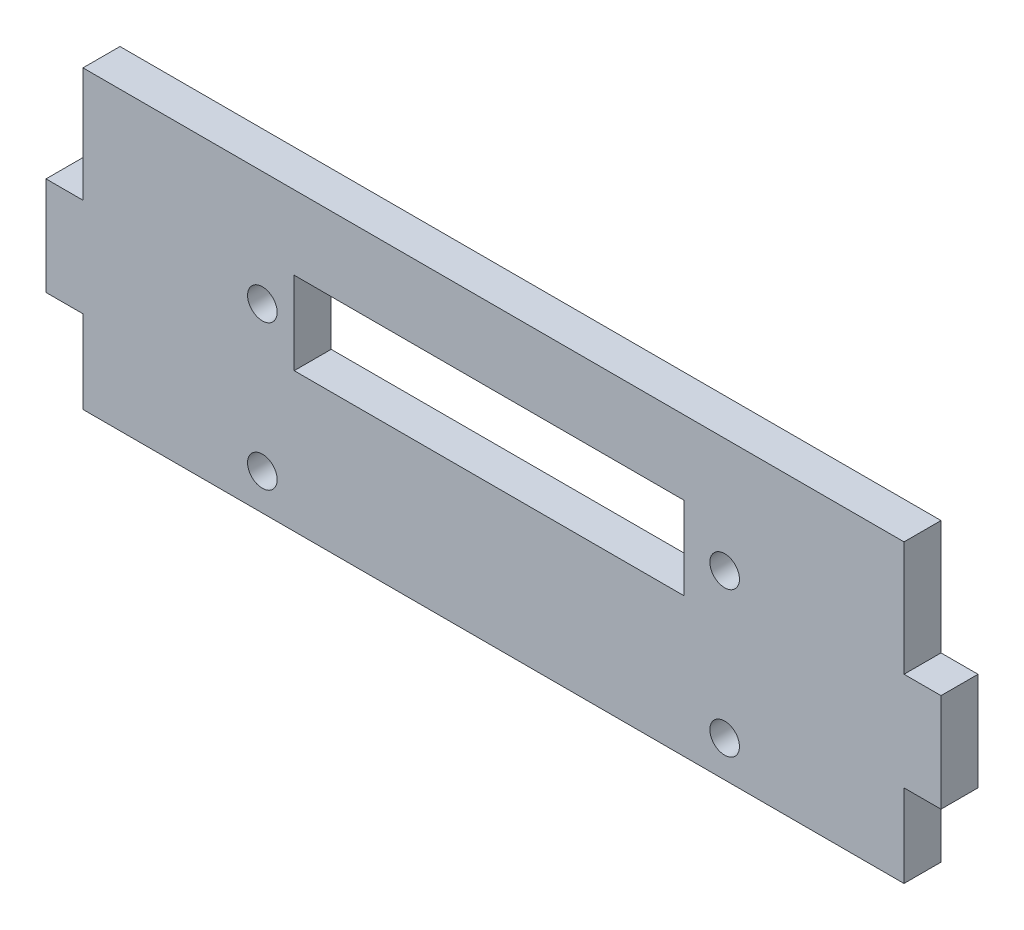
ISO-10303-21;
HEADER;
FILE_DESCRIPTION(('STEP AP214'),'2;1');
FILE_NAME('part.step','',(''),(''),'','','');
FILE_SCHEMA(('AUTOMOTIVE_DESIGN { 1 0 10303 214 1 1 1 1 }'));
ENDSEC;
DATA;
#1=APPLICATION_CONTEXT('core data for automotive mechanical design processes');
#2=APPLICATION_PROTOCOL_DEFINITION('international standard','automotive_design',2000,#1);
#3=PRODUCT_CONTEXT('',#1,'mechanical');
#4=PRODUCT('Part','Part','',(#3));
#5=PRODUCT_RELATED_PRODUCT_CATEGORY('part','',(#4));
#6=PRODUCT_DEFINITION_FORMATION('','',#4);
#7=PRODUCT_DEFINITION_CONTEXT('part definition',#1,'design');
#8=PRODUCT_DEFINITION('design','',#6,#7);
#9=PRODUCT_DEFINITION_SHAPE('','',#8);
#10=(LENGTH_UNIT() NAMED_UNIT(*) SI_UNIT(.MILLI.,.METRE.));
#11=(NAMED_UNIT(*) PLANE_ANGLE_UNIT() SI_UNIT($,.RADIAN.));
#12=(NAMED_UNIT(*) SI_UNIT($,.STERADIAN.) SOLID_ANGLE_UNIT());
#13=UNCERTAINTY_MEASURE_WITH_UNIT(LENGTH_MEASURE(1.E-05),#10,'distance_accuracy_value','');
#14=(GEOMETRIC_REPRESENTATION_CONTEXT(3) GLOBAL_UNCERTAINTY_ASSIGNED_CONTEXT((#13)) GLOBAL_UNIT_ASSIGNED_CONTEXT((#10,
#11,#12)) REPRESENTATION_CONTEXT('',''));
#15=CARTESIAN_POINT('',(0.,0.,0.));
#16=DIRECTION('',(0.,0.,1.));
#17=DIRECTION('',(1.,0.,0.));
#18=AXIS2_PLACEMENT_3D('',#15,#16,#17);
#19=CARTESIAN_POINT('',(111.,0.,5.));
#20=DIRECTION('',(-1.,0.,0.));
#21=DIRECTION('',(0.,0.,1.));
#22=AXIS2_PLACEMENT_3D('',#19,#20,#21);
#23=PLANE('',#22);
#24=DIRECTION('',(0.,0.,1.));
#25=VECTOR('',#24,1.);
#26=CARTESIAN_POINT('',(111.,24.5,5.));
#27=LINE('',#26,#25);
#28=CARTESIAN_POINT('',(111.,24.5,0.));
#29=VERTEX_POINT('',#28);
#30=CARTESIAN_POINT('',(111.,24.5,5.));
#31=VERTEX_POINT('',#30);
#32=EDGE_CURVE('E174',#29,#31,#27,.T.);
#33=ORIENTED_EDGE('',*,*,#32,.F.);
#34=DIRECTION('',(0.,1.,0.));
#35=VECTOR('',#34,1.);
#36=CARTESIAN_POINT('',(111.,0.,0.));
#37=LINE('',#36,#35);
#38=CARTESIAN_POINT('',(111.,40.,0.));
#39=VERTEX_POINT('',#38);
#40=EDGE_CURVE('E258',#29,#39,#37,.T.);
#41=ORIENTED_EDGE('',*,*,#40,.T.);
#42=DIRECTION('',(0.,0.,-1.));
#43=VECTOR('',#42,1.);
#44=CARTESIAN_POINT('',(111.,40.,5.));
#45=LINE('',#44,#43);
#46=CARTESIAN_POINT('',(111.,40.,5.));
#47=VERTEX_POINT('',#46);
#48=EDGE_CURVE('E265',#47,#39,#45,.T.);
#49=ORIENTED_EDGE('',*,*,#48,.F.);
#50=DIRECTION('',(0.,1.,0.));
#51=VECTOR('',#50,1.);
#52=CARTESIAN_POINT('',(111.,0.,5.));
#53=LINE('',#52,#51);
#54=EDGE_CURVE('E57',#31,#47,#53,.T.);
#55=ORIENTED_EDGE('',*,*,#54,.F.);
#56=EDGE_LOOP('',(#33,#41,#49,#55));
#57=FACE_BOUND('',#56,.T.);
#58=ADVANCED_FACE('F40',(#57),#23,.F.);
#59=DIRECTION('',(0.,0.,-1.));
#60=VECTOR('',#59,1.);
#61=CARTESIAN_POINT('',(111.,11.2,5.));
#62=LINE('',#61,#60);
#63=CARTESIAN_POINT('',(111.,11.2,5.));
#64=VERTEX_POINT('',#63);
#65=CARTESIAN_POINT('',(111.,11.2,0.));
#66=VERTEX_POINT('',#65);
#67=EDGE_CURVE('E65',#64,#66,#62,.T.);
#68=ORIENTED_EDGE('',*,*,#67,.F.);
#69=CARTESIAN_POINT('',(111.,0.,5.));
#70=VERTEX_POINT('',#69);
#71=EDGE_CURVE('E178',#70,#64,#53,.T.);
#72=ORIENTED_EDGE('',*,*,#71,.F.);
#73=DIRECTION('',(0.,0.,-1.));
#74=VECTOR('',#73,1.);
#75=CARTESIAN_POINT('',(111.,0.,5.));
#76=LINE('',#75,#74);
#77=CARTESIAN_POINT('',(111.,0.,0.));
#78=VERTEX_POINT('',#77);
#79=EDGE_CURVE('E268',#70,#78,#76,.T.);
#80=ORIENTED_EDGE('',*,*,#79,.T.);
#81=EDGE_CURVE('E259',#78,#66,#37,.T.);
#82=ORIENTED_EDGE('',*,*,#81,.T.);
#83=EDGE_LOOP('',(#68,#72,#80,#82));
#84=FACE_BOUND('',#83,.T.);
#85=ADVANCED_FACE('F336',(#84),#23,.F.);
#86=CARTESIAN_POINT('',(0.,0.,5.));
#87=DIRECTION('',(1.,0.,0.));
#88=DIRECTION('',(0.,0.,-1.));
#89=AXIS2_PLACEMENT_3D('',#86,#87,#88);
#90=PLANE('',#89);
#91=DIRECTION('',(0.,0.,-1.));
#92=VECTOR('',#91,1.);
#93=CARTESIAN_POINT('',(0.,24.5,0.));
#94=LINE('',#93,#92);
#95=CARTESIAN_POINT('',(0.,24.5,5.));
#96=VERTEX_POINT('',#95);
#97=CARTESIAN_POINT('',(0.,24.5,0.));
#98=VERTEX_POINT('',#97);
#99=EDGE_CURVE('E182',#96,#98,#94,.T.);
#100=ORIENTED_EDGE('',*,*,#99,.F.);
#101=DIRECTION('',(0.,-1.,0.));
#102=VECTOR('',#101,1.);
#103=CARTESIAN_POINT('',(0.,0.,5.));
#104=LINE('',#103,#102);
#105=CARTESIAN_POINT('',(0.,40.,5.));
#106=VERTEX_POINT('',#105);
#107=EDGE_CURVE('E244',#106,#96,#104,.T.);
#108=ORIENTED_EDGE('',*,*,#107,.F.);
#109=DIRECTION('',(0.,0.,-1.));
#110=VECTOR('',#109,1.);
#111=CARTESIAN_POINT('',(0.,40.,5.));
#112=LINE('',#111,#110);
#113=CARTESIAN_POINT('',(0.,40.,0.));
#114=VERTEX_POINT('',#113);
#115=EDGE_CURVE('E252',#106,#114,#112,.T.);
#116=ORIENTED_EDGE('',*,*,#115,.T.);
#117=DIRECTION('',(0.,-1.,0.));
#118=VECTOR('',#117,1.);
#119=CARTESIAN_POINT('',(0.,0.,0.));
#120=LINE('',#119,#118);
#121=EDGE_CURVE('E253',#114,#98,#120,.T.);
#122=ORIENTED_EDGE('',*,*,#121,.T.);
#123=EDGE_LOOP('',(#100,#108,#116,#122));
#124=FACE_BOUND('',#123,.T.);
#125=ADVANCED_FACE('F42',(#124),#90,.F.);
#126=DIRECTION('',(0.,0.,1.));
#127=VECTOR('',#126,1.);
#128=CARTESIAN_POINT('',(0.,11.2,0.));
#129=LINE('',#128,#127);
#130=CARTESIAN_POINT('',(0.,11.2,0.));
#131=VERTEX_POINT('',#130);
#132=CARTESIAN_POINT('',(0.,11.2,5.));
#133=VERTEX_POINT('',#132);
#134=EDGE_CURVE('E179',#131,#133,#129,.T.);
#135=ORIENTED_EDGE('',*,*,#134,.F.);
#136=CARTESIAN_POINT('',(0.,0.,0.));
#137=VERTEX_POINT('',#136);
#138=EDGE_CURVE('E256',#131,#137,#120,.T.);
#139=ORIENTED_EDGE('',*,*,#138,.T.);
#140=DIRECTION('',(0.,0.,-1.));
#141=VECTOR('',#140,1.);
#142=CARTESIAN_POINT('',(0.,0.,5.));
#143=LINE('',#142,#141);
#144=CARTESIAN_POINT('',(0.,0.,5.));
#145=VERTEX_POINT('',#144);
#146=EDGE_CURVE('E271',#145,#137,#143,.T.);
#147=ORIENTED_EDGE('',*,*,#146,.F.);
#148=EDGE_CURVE('E247',#133,#145,#104,.T.);
#149=ORIENTED_EDGE('',*,*,#148,.F.);
#150=EDGE_LOOP('',(#135,#139,#147,#149));
#151=FACE_BOUND('',#150,.T.);
#152=ADVANCED_FACE('F295',(#151),#90,.F.);
#153=CARTESIAN_POINT('',(0.,0.,5.));
#154=DIRECTION('',(0.,1.,0.));
#155=DIRECTION('',(0.,0.,1.));
#156=AXIS2_PLACEMENT_3D('',#153,#154,#155);
#157=PLANE('',#156);
#158=DIRECTION('',(1.,0.,0.));
#159=VECTOR('',#158,1.);
#160=CARTESIAN_POINT('',(0.,0.,0.));
#161=LINE('',#160,#159);
#162=EDGE_CURVE('E255',#137,#78,#161,.T.);
#163=ORIENTED_EDGE('',*,*,#162,.T.);
#164=ORIENTED_EDGE('',*,*,#79,.F.);
#165=DIRECTION('',(1.,0.,0.));
#166=VECTOR('',#165,1.);
#167=CARTESIAN_POINT('',(0.,0.,5.));
#168=LINE('',#167,#166);
#169=EDGE_CURVE('E246',#145,#70,#168,.T.);
#170=ORIENTED_EDGE('',*,*,#169,.F.);
#171=ORIENTED_EDGE('',*,*,#146,.T.);
#172=EDGE_LOOP('',(#163,#164,#170,#171));
#173=FACE_BOUND('',#172,.T.);
#174=ADVANCED_FACE('F304',(#173),#157,.F.);
#175=CARTESIAN_POINT('',(0.,40.,5.));
#176=DIRECTION('',(0.,-1.,0.));
#177=DIRECTION('',(0.,0.,-1.));
#178=AXIS2_PLACEMENT_3D('',#175,#176,#177);
#179=PLANE('',#178);
#180=DIRECTION('',(-1.,0.,0.));
#181=VECTOR('',#180,1.);
#182=CARTESIAN_POINT('',(0.,40.,0.));
#183=LINE('',#182,#181);
#184=EDGE_CURVE('E261',#39,#114,#183,.T.);
#185=ORIENTED_EDGE('',*,*,#184,.T.);
#186=ORIENTED_EDGE('',*,*,#115,.F.);
#187=DIRECTION('',(-1.,0.,0.));
#188=VECTOR('',#187,1.);
#189=CARTESIAN_POINT('',(0.,40.,5.));
#190=LINE('',#189,#188);
#191=EDGE_CURVE('E250',#47,#106,#190,.T.);
#192=ORIENTED_EDGE('',*,*,#191,.F.);
#193=ORIENTED_EDGE('',*,*,#48,.T.);
#194=EDGE_LOOP('',(#185,#186,#192,#193));
#195=FACE_BOUND('',#194,.T.);
#196=ADVANCED_FACE('F322',(#195),#179,.F.);
#197=CARTESIAN_POINT('',(0.,0.,5.));
#198=DIRECTION('',(0.,0.,-1.));
#199=DIRECTION('',(-1.,0.,0.));
#200=AXIS2_PLACEMENT_3D('',#197,#198,#199);
#201=PLANE('',#200);
#202=CARTESIAN_POINT('',(86.75,24.5,5.));
#203=DIRECTION('',(0.,0.,1.));
#204=DIRECTION('',(1.,0.,0.));
#205=AXIS2_PLACEMENT_3D('',#202,#203,#204);
#206=CIRCLE('',#205,2.);
#207=CARTESIAN_POINT('',(88.75,24.5,5.));
#208=VERTEX_POINT('',#207);
#209=EDGE_CURVE('E235',#208,#208,#206,.T.);
#210=ORIENTED_EDGE('',*,*,#209,.F.);
#211=EDGE_LOOP('',(#210));
#212=FACE_BOUND('',#211,.T.);
#213=CARTESIAN_POINT('',(24.25,4.9,5.));
#214=DIRECTION('',(0.,0.,1.));
#215=DIRECTION('',(1.,0.,0.));
#216=AXIS2_PLACEMENT_3D('',#213,#214,#215);
#217=CIRCLE('',#216,2.);
#218=CARTESIAN_POINT('',(26.25,4.9,5.));
#219=VERTEX_POINT('',#218);
#220=EDGE_CURVE('E215',#219,#219,#217,.T.);
#221=ORIENTED_EDGE('',*,*,#220,.F.);
#222=EDGE_LOOP('',(#221));
#223=FACE_BOUND('',#222,.T.);
#224=CARTESIAN_POINT('',(86.75,4.9,5.));
#225=DIRECTION('',(0.,0.,1.));
#226=DIRECTION('',(1.,0.,0.));
#227=AXIS2_PLACEMENT_3D('',#224,#225,#226);
#228=CIRCLE('',#227,2.);
#229=CARTESIAN_POINT('',(88.75,4.9,5.));
#230=VERTEX_POINT('',#229);
#231=EDGE_CURVE('E212',#230,#230,#228,.T.);
#232=ORIENTED_EDGE('',*,*,#231,.F.);
#233=EDGE_LOOP('',(#232));
#234=FACE_BOUND('',#233,.T.);
#235=DIRECTION('',(1.,0.,0.));
#236=VECTOR('',#235,1.);
#237=CARTESIAN_POINT('',(28.5554986658765,18.8204020153264,5.));
#238=LINE('',#237,#236);
#239=CARTESIAN_POINT('',(28.5554986658765,18.8204020153264,5.));
#240=VERTEX_POINT('',#239);
#241=CARTESIAN_POINT('',(81.2554986658765,18.8204020153264,5.));
#242=VERTEX_POINT('',#241);
#243=EDGE_CURVE('E218',#240,#242,#238,.T.);
#244=ORIENTED_EDGE('',*,*,#243,.F.);
#245=DIRECTION('',(0.,-1.,0.));
#246=VECTOR('',#245,1.);
#247=CARTESIAN_POINT('',(28.5554986658765,30.,5.));
#248=LINE('',#247,#246);
#249=CARTESIAN_POINT('',(28.5554986658765,30.,5.));
#250=VERTEX_POINT('',#249);
#251=EDGE_CURVE('E211',#250,#240,#248,.T.);
#252=ORIENTED_EDGE('',*,*,#251,.F.);
#253=DIRECTION('',(-1.,0.,0.));
#254=VECTOR('',#253,1.);
#255=CARTESIAN_POINT('',(28.5554986658765,30.,5.));
#256=LINE('',#255,#254);
#257=CARTESIAN_POINT('',(81.2554986658765,30.,5.));
#258=VERTEX_POINT('',#257);
#259=EDGE_CURVE('E224',#258,#250,#256,.T.);
#260=ORIENTED_EDGE('',*,*,#259,.F.);
#261=DIRECTION('',(0.,1.,0.));
#262=VECTOR('',#261,1.);
#263=CARTESIAN_POINT('',(81.2554986658765,30.,5.));
#264=LINE('',#263,#262);
#265=EDGE_CURVE('E221',#242,#258,#264,.T.);
#266=ORIENTED_EDGE('',*,*,#265,.F.);
#267=EDGE_LOOP('',(#244,#252,#260,#266));
#268=FACE_BOUND('',#267,.T.);
#269=CARTESIAN_POINT('',(24.25,24.5,5.));
#270=DIRECTION('',(0.,0.,1.));
#271=DIRECTION('',(1.,0.,0.));
#272=AXIS2_PLACEMENT_3D('',#269,#270,#271);
#273=CIRCLE('',#272,2.00000000000001);
#274=CARTESIAN_POINT('',(26.25,24.5,5.));
#275=VERTEX_POINT('',#274);
#276=EDGE_CURVE('E238',#275,#275,#273,.T.);
#277=ORIENTED_EDGE('',*,*,#276,.F.);
#278=EDGE_LOOP('',(#277));
#279=FACE_BOUND('',#278,.T.);
#280=ORIENTED_EDGE('',*,*,#107,.T.);
#281=DIRECTION('',(1.,0.,0.));
#282=VECTOR('',#281,1.);
#283=CARTESIAN_POINT('',(-5.,24.5,5.));
#284=LINE('',#283,#282);
#285=CARTESIAN_POINT('',(-5.,24.5,5.));
#286=VERTEX_POINT('',#285);
#287=EDGE_CURVE('E202',#286,#96,#284,.T.);
#288=ORIENTED_EDGE('',*,*,#287,.F.);
#289=DIRECTION('',(0.,1.,0.));
#290=VECTOR('',#289,1.);
#291=CARTESIAN_POINT('',(-5.,24.5,5.));
#292=LINE('',#291,#290);
#293=CARTESIAN_POINT('',(-5.,11.2,5.));
#294=VERTEX_POINT('',#293);
#295=EDGE_CURVE('E193',#294,#286,#292,.T.);
#296=ORIENTED_EDGE('',*,*,#295,.F.);
#297=DIRECTION('',(1.,0.,0.));
#298=VECTOR('',#297,1.);
#299=CARTESIAN_POINT('',(-5.,11.2,5.));
#300=LINE('',#299,#298);
#301=EDGE_CURVE('E205',#294,#133,#300,.T.);
#302=ORIENTED_EDGE('',*,*,#301,.T.);
#303=ORIENTED_EDGE('',*,*,#148,.T.);
#304=ORIENTED_EDGE('',*,*,#169,.T.);
#305=ORIENTED_EDGE('',*,*,#71,.T.);
#306=DIRECTION('',(-1.,0.,0.));
#307=VECTOR('',#306,1.);
#308=CARTESIAN_POINT('',(116.,11.2,5.));
#309=LINE('',#308,#307);
#310=CARTESIAN_POINT('',(116.,11.2,5.));
#311=VERTEX_POINT('',#310);
#312=EDGE_CURVE('E159',#311,#64,#309,.T.);
#313=ORIENTED_EDGE('',*,*,#312,.F.);
#314=DIRECTION('',(0.,-1.,0.));
#315=VECTOR('',#314,1.);
#316=CARTESIAN_POINT('',(116.,24.5,5.));
#317=LINE('',#316,#315);
#318=CARTESIAN_POINT('',(116.,24.5,5.));
#319=VERTEX_POINT('',#318);
#320=EDGE_CURVE('E165',#319,#311,#317,.T.);
#321=ORIENTED_EDGE('',*,*,#320,.F.);
#322=DIRECTION('',(-1.,0.,0.));
#323=VECTOR('',#322,1.);
#324=CARTESIAN_POINT('',(116.,24.5,5.));
#325=LINE('',#324,#323);
#326=EDGE_CURVE('E329',#319,#31,#325,.T.);
#327=ORIENTED_EDGE('',*,*,#326,.T.);
#328=ORIENTED_EDGE('',*,*,#54,.T.);
#329=ORIENTED_EDGE('',*,*,#191,.T.);
#330=EDGE_LOOP('',(#280,#288,#296,#302,#303,#304,#305,#313,#321,#327,#328,#329));
#331=FACE_BOUND('',#330,.T.);
#332=ADVANCED_FACE('F177',(#212,#223,#234,#268,#279,#331),#201,.F.);
#333=CARTESIAN_POINT('',(0.,0.,0.));
#334=DIRECTION('',(0.,0.,-1.));
#335=DIRECTION('',(-1.,0.,0.));
#336=AXIS2_PLACEMENT_3D('',#333,#334,#335);
#337=PLANE('',#336);
#338=CARTESIAN_POINT('',(86.75,24.5,0.));
#339=DIRECTION('',(0.,0.,-1.));
#340=DIRECTION('',(-1.,0.,0.));
#341=AXIS2_PLACEMENT_3D('',#338,#339,#340);
#342=CIRCLE('',#341,2.);
#343=CARTESIAN_POINT('',(84.75,24.5,0.));
#344=VERTEX_POINT('',#343);
#345=EDGE_CURVE('E44',#344,#344,#342,.T.);
#346=ORIENTED_EDGE('',*,*,#345,.F.);
#347=EDGE_LOOP('',(#346));
#348=FACE_BOUND('',#347,.T.);
#349=CARTESIAN_POINT('',(24.25,4.9,0.));
#350=DIRECTION('',(0.,0.,-1.));
#351=DIRECTION('',(-1.,0.,0.));
#352=AXIS2_PLACEMENT_3D('',#349,#350,#351);
#353=CIRCLE('',#352,2.);
#354=CARTESIAN_POINT('',(22.25,4.9,0.));
#355=VERTEX_POINT('',#354);
#356=EDGE_CURVE('E284',#355,#355,#353,.T.);
#357=ORIENTED_EDGE('',*,*,#356,.F.);
#358=EDGE_LOOP('',(#357));
#359=FACE_BOUND('',#358,.T.);
#360=CARTESIAN_POINT('',(86.75,4.9,0.));
#361=DIRECTION('',(0.,0.,-1.));
#362=DIRECTION('',(-1.,0.,0.));
#363=AXIS2_PLACEMENT_3D('',#360,#361,#362);
#364=CIRCLE('',#363,2.);
#365=CARTESIAN_POINT('',(84.75,4.9,0.));
#366=VERTEX_POINT('',#365);
#367=EDGE_CURVE('E277',#366,#366,#364,.T.);
#368=ORIENTED_EDGE('',*,*,#367,.F.);
#369=EDGE_LOOP('',(#368));
#370=FACE_BOUND('',#369,.T.);
#371=DIRECTION('',(0.,1.,0.));
#372=VECTOR('',#371,1.);
#373=CARTESIAN_POINT('',(28.5554986658765,0.,0.));
#374=LINE('',#373,#372);
#375=CARTESIAN_POINT('',(28.5554986658765,18.8204020153264,0.));
#376=VERTEX_POINT('',#375);
#377=CARTESIAN_POINT('',(28.5554986658765,30.,0.));
#378=VERTEX_POINT('',#377);
#379=EDGE_CURVE('E11',#376,#378,#374,.T.);
#380=ORIENTED_EDGE('',*,*,#379,.F.);
#381=DIRECTION('',(-1.,0.,0.));
#382=VECTOR('',#381,1.);
#383=CARTESIAN_POINT('',(0.,18.8204020153264,0.));
#384=LINE('',#383,#382);
#385=CARTESIAN_POINT('',(81.2554986658765,18.8204020153264,0.));
#386=VERTEX_POINT('',#385);
#387=EDGE_CURVE('E274',#386,#376,#384,.T.);
#388=ORIENTED_EDGE('',*,*,#387,.F.);
#389=DIRECTION('',(0.,-1.,0.));
#390=VECTOR('',#389,1.);
#391=CARTESIAN_POINT('',(81.2554986658765,0.,0.));
#392=LINE('',#391,#390);
#393=CARTESIAN_POINT('',(81.2554986658765,30.,0.));
#394=VERTEX_POINT('',#393);
#395=EDGE_CURVE('E279',#394,#386,#392,.T.);
#396=ORIENTED_EDGE('',*,*,#395,.F.);
#397=DIRECTION('',(1.,0.,0.));
#398=VECTOR('',#397,1.);
#399=CARTESIAN_POINT('',(0.,30.,0.));
#400=LINE('',#399,#398);
#401=EDGE_CURVE('E49',#378,#394,#400,.T.);
#402=ORIENTED_EDGE('',*,*,#401,.F.);
#403=EDGE_LOOP('',(#380,#388,#396,#402));
#404=FACE_BOUND('',#403,.T.);
#405=CARTESIAN_POINT('',(24.25,24.5,0.));
#406=DIRECTION('',(0.,0.,-1.));
#407=DIRECTION('',(-1.,0.,0.));
#408=AXIS2_PLACEMENT_3D('',#405,#406,#407);
#409=CIRCLE('',#408,2.00000000000001);
#410=CARTESIAN_POINT('',(22.25,24.5,0.));
#411=VERTEX_POINT('',#410);
#412=EDGE_CURVE('E243',#411,#411,#409,.T.);
#413=ORIENTED_EDGE('',*,*,#412,.F.);
#414=EDGE_LOOP('',(#413));
#415=FACE_BOUND('',#414,.T.);
#416=ORIENTED_EDGE('',*,*,#121,.F.);
#417=ORIENTED_EDGE('',*,*,#184,.F.);
#418=ORIENTED_EDGE('',*,*,#40,.F.);
#419=DIRECTION('',(-1.,0.,0.));
#420=VECTOR('',#419,1.);
#421=CARTESIAN_POINT('',(116.,24.5,0.));
#422=LINE('',#421,#420);
#423=CARTESIAN_POINT('',(116.,24.5,0.));
#424=VERTEX_POINT('',#423);
#425=EDGE_CURVE('E184',#424,#29,#422,.T.);
#426=ORIENTED_EDGE('',*,*,#425,.F.);
#427=DIRECTION('',(0.,1.,0.));
#428=VECTOR('',#427,1.);
#429=CARTESIAN_POINT('',(116.,24.5,0.));
#430=LINE('',#429,#428);
#431=CARTESIAN_POINT('',(116.,11.2,0.));
#432=VERTEX_POINT('',#431);
#433=EDGE_CURVE('E164',#432,#424,#430,.T.);
#434=ORIENTED_EDGE('',*,*,#433,.F.);
#435=DIRECTION('',(-1.,0.,0.));
#436=VECTOR('',#435,1.);
#437=CARTESIAN_POINT('',(116.,11.2,0.));
#438=LINE('',#437,#436);
#439=EDGE_CURVE('E161',#432,#66,#438,.T.);
#440=ORIENTED_EDGE('',*,*,#439,.T.);
#441=ORIENTED_EDGE('',*,*,#81,.F.);
#442=ORIENTED_EDGE('',*,*,#162,.F.);
#443=ORIENTED_EDGE('',*,*,#138,.F.);
#444=DIRECTION('',(1.,0.,0.));
#445=VECTOR('',#444,1.);
#446=CARTESIAN_POINT('',(-5.,11.2,0.));
#447=LINE('',#446,#445);
#448=CARTESIAN_POINT('',(-5.,11.2,0.));
#449=VERTEX_POINT('',#448);
#450=EDGE_CURVE('E208',#449,#131,#447,.T.);
#451=ORIENTED_EDGE('',*,*,#450,.F.);
#452=DIRECTION('',(0.,-1.,0.));
#453=VECTOR('',#452,1.);
#454=CARTESIAN_POINT('',(-5.,24.5,0.));
#455=LINE('',#454,#453);
#456=CARTESIAN_POINT('',(-5.,24.5,0.));
#457=VERTEX_POINT('',#456);
#458=EDGE_CURVE('E188',#457,#449,#455,.T.);
#459=ORIENTED_EDGE('',*,*,#458,.F.);
#460=DIRECTION('',(1.,0.,0.));
#461=VECTOR('',#460,1.);
#462=CARTESIAN_POINT('',(-5.,24.5,0.));
#463=LINE('',#462,#461);
#464=EDGE_CURVE('E196',#457,#98,#463,.T.);
#465=ORIENTED_EDGE('',*,*,#464,.T.);
#466=EDGE_LOOP('',(#416,#417,#418,#426,#434,#440,#441,#442,#443,#451,#459,#465));
#467=FACE_BOUND('',#466,.T.);
#468=ADVANCED_FACE('F300',(#348,#359,#370,#404,#415,#467),#337,.T.);
#469=CARTESIAN_POINT('',(24.25,24.5,-5.));
#470=DIRECTION('',(0.,0.,1.));
#471=DIRECTION('',(1.,0.,0.));
#472=AXIS2_PLACEMENT_3D('',#469,#470,#471);
#473=CYLINDRICAL_SURFACE('',#472,2.00000000000001);
#474=ORIENTED_EDGE('',*,*,#412,.T.);
#475=EDGE_LOOP('',(#474));
#476=FACE_BOUND('',#475,.T.);
#477=ORIENTED_EDGE('',*,*,#276,.T.);
#478=EDGE_LOOP('',(#477));
#479=FACE_BOUND('',#478,.T.);
#480=ADVANCED_FACE('F381',(#476,#479),#473,.F.);
#481=CARTESIAN_POINT('',(28.5554986658765,30.,-5.));
#482=DIRECTION('',(-1.,0.,0.));
#483=DIRECTION('',(0.,0.,1.));
#484=AXIS2_PLACEMENT_3D('',#481,#482,#483);
#485=PLANE('',#484);
#486=ORIENTED_EDGE('',*,*,#379,.T.);
#487=DIRECTION('',(0.,0.,1.));
#488=VECTOR('',#487,1.);
#489=CARTESIAN_POINT('',(28.5554986658765,30.,-5.));
#490=LINE('',#489,#488);
#491=EDGE_CURVE('E216',#378,#250,#490,.T.);
#492=ORIENTED_EDGE('',*,*,#491,.T.);
#493=ORIENTED_EDGE('',*,*,#251,.T.);
#494=DIRECTION('',(0.,0.,1.));
#495=VECTOR('',#494,1.);
#496=CARTESIAN_POINT('',(28.5554986658765,18.8204020153264,-5.));
#497=LINE('',#496,#495);
#498=EDGE_CURVE('E227',#376,#240,#497,.T.);
#499=ORIENTED_EDGE('',*,*,#498,.F.);
#500=EDGE_LOOP('',(#486,#492,#493,#499));
#501=FACE_BOUND('',#500,.T.);
#502=ADVANCED_FACE('F429',(#501),#485,.F.);
#503=CARTESIAN_POINT('',(28.5554986658765,30.,-5.));
#504=DIRECTION('',(0.,1.,0.));
#505=DIRECTION('',(0.,0.,1.));
#506=AXIS2_PLACEMENT_3D('',#503,#504,#505);
#507=PLANE('',#506);
#508=ORIENTED_EDGE('',*,*,#401,.T.);
#509=DIRECTION('',(0.,0.,1.));
#510=VECTOR('',#509,1.);
#511=CARTESIAN_POINT('',(81.2554986658765,30.,-5.));
#512=LINE('',#511,#510);
#513=EDGE_CURVE('E229',#394,#258,#512,.T.);
#514=ORIENTED_EDGE('',*,*,#513,.T.);
#515=ORIENTED_EDGE('',*,*,#259,.T.);
#516=ORIENTED_EDGE('',*,*,#491,.F.);
#517=EDGE_LOOP('',(#508,#514,#515,#516));
#518=FACE_BOUND('',#517,.T.);
#519=ADVANCED_FACE('F425',(#518),#507,.F.);
#520=CARTESIAN_POINT('',(81.2554986658765,30.,-5.));
#521=DIRECTION('',(1.,0.,0.));
#522=DIRECTION('',(0.,0.,-1.));
#523=AXIS2_PLACEMENT_3D('',#520,#521,#522);
#524=PLANE('',#523);
#525=ORIENTED_EDGE('',*,*,#395,.T.);
#526=DIRECTION('',(0.,0.,1.));
#527=VECTOR('',#526,1.);
#528=CARTESIAN_POINT('',(81.2554986658765,18.8204020153264,-5.));
#529=LINE('',#528,#527);
#530=EDGE_CURVE('E231',#386,#242,#529,.T.);
#531=ORIENTED_EDGE('',*,*,#530,.T.);
#532=ORIENTED_EDGE('',*,*,#265,.T.);
#533=ORIENTED_EDGE('',*,*,#513,.F.);
#534=EDGE_LOOP('',(#525,#531,#532,#533));
#535=FACE_BOUND('',#534,.T.);
#536=ADVANCED_FACE('F428',(#535),#524,.F.);
#537=CARTESIAN_POINT('',(28.5554986658765,18.8204020153264,-5.));
#538=DIRECTION('',(0.,-1.,0.));
#539=DIRECTION('',(0.,0.,-1.));
#540=AXIS2_PLACEMENT_3D('',#537,#538,#539);
#541=PLANE('',#540);
#542=ORIENTED_EDGE('',*,*,#387,.T.);
#543=ORIENTED_EDGE('',*,*,#498,.T.);
#544=ORIENTED_EDGE('',*,*,#243,.T.);
#545=ORIENTED_EDGE('',*,*,#530,.F.);
#546=EDGE_LOOP('',(#542,#543,#544,#545));
#547=FACE_BOUND('',#546,.T.);
#548=ADVANCED_FACE('F423',(#547),#541,.F.);
#549=CARTESIAN_POINT('',(86.75,4.9,-5.));
#550=DIRECTION('',(0.,0.,1.));
#551=DIRECTION('',(1.,0.,0.));
#552=AXIS2_PLACEMENT_3D('',#549,#550,#551);
#553=CYLINDRICAL_SURFACE('',#552,2.);
#554=ORIENTED_EDGE('',*,*,#367,.T.);
#555=EDGE_LOOP('',(#554));
#556=FACE_BOUND('',#555,.T.);
#557=ORIENTED_EDGE('',*,*,#231,.T.);
#558=EDGE_LOOP('',(#557));
#559=FACE_BOUND('',#558,.T.);
#560=ADVANCED_FACE('F419',(#556,#559),#553,.F.);
#561=CARTESIAN_POINT('',(24.25,4.9,-5.));
#562=DIRECTION('',(0.,0.,1.));
#563=DIRECTION('',(1.,0.,0.));
#564=AXIS2_PLACEMENT_3D('',#561,#562,#563);
#565=CYLINDRICAL_SURFACE('',#564,2.);
#566=ORIENTED_EDGE('',*,*,#356,.T.);
#567=EDGE_LOOP('',(#566));
#568=FACE_BOUND('',#567,.T.);
#569=ORIENTED_EDGE('',*,*,#220,.T.);
#570=EDGE_LOOP('',(#569));
#571=FACE_BOUND('',#570,.T.);
#572=ADVANCED_FACE('F422',(#568,#571),#565,.F.);
#573=CARTESIAN_POINT('',(86.75,24.5,-5.));
#574=DIRECTION('',(0.,0.,1.));
#575=DIRECTION('',(1.,0.,0.));
#576=AXIS2_PLACEMENT_3D('',#573,#574,#575);
#577=CYLINDRICAL_SURFACE('',#576,2.);
#578=ORIENTED_EDGE('',*,*,#345,.T.);
#579=EDGE_LOOP('',(#578));
#580=FACE_BOUND('',#579,.T.);
#581=ORIENTED_EDGE('',*,*,#209,.T.);
#582=EDGE_LOOP('',(#581));
#583=FACE_BOUND('',#582,.T.);
#584=ADVANCED_FACE('F418',(#580,#583),#577,.F.);
#585=CARTESIAN_POINT('',(-5.,11.2,0.));
#586=DIRECTION('',(0.,1.,0.));
#587=DIRECTION('',(0.,0.,1.));
#588=AXIS2_PLACEMENT_3D('',#585,#586,#587);
#589=PLANE('',#588);
#590=ORIENTED_EDGE('',*,*,#134,.T.);
#591=ORIENTED_EDGE('',*,*,#301,.F.);
#592=DIRECTION('',(0.,0.,1.));
#593=VECTOR('',#592,1.);
#594=CARTESIAN_POINT('',(-5.,11.2,0.));
#595=LINE('',#594,#593);
#596=EDGE_CURVE('E191',#449,#294,#595,.T.);
#597=ORIENTED_EDGE('',*,*,#596,.F.);
#598=ORIENTED_EDGE('',*,*,#450,.T.);
#599=EDGE_LOOP('',(#590,#591,#597,#598));
#600=FACE_BOUND('',#599,.T.);
#601=ADVANCED_FACE('F308',(#600),#589,.F.);
#602=CARTESIAN_POINT('',(-5.,24.5,0.));
#603=DIRECTION('',(0.,-1.,0.));
#604=DIRECTION('',(0.,0.,-1.));
#605=AXIS2_PLACEMENT_3D('',#602,#603,#604);
#606=PLANE('',#605);
#607=ORIENTED_EDGE('',*,*,#99,.T.);
#608=ORIENTED_EDGE('',*,*,#464,.F.);
#609=DIRECTION('',(0.,0.,-1.));
#610=VECTOR('',#609,1.);
#611=CARTESIAN_POINT('',(-5.,24.5,0.));
#612=LINE('',#611,#610);
#613=EDGE_CURVE('E195',#286,#457,#612,.T.);
#614=ORIENTED_EDGE('',*,*,#613,.F.);
#615=ORIENTED_EDGE('',*,*,#287,.T.);
#616=EDGE_LOOP('',(#607,#608,#614,#615));
#617=FACE_BOUND('',#616,.T.);
#618=ADVANCED_FACE('F316',(#617),#606,.F.);
#619=CARTESIAN_POINT('',(-5.,0.,0.));
#620=DIRECTION('',(-1.,0.,0.));
#621=DIRECTION('',(0.,0.,1.));
#622=AXIS2_PLACEMENT_3D('',#619,#620,#621);
#623=PLANE('',#622);
#624=ORIENTED_EDGE('',*,*,#458,.T.);
#625=ORIENTED_EDGE('',*,*,#596,.T.);
#626=ORIENTED_EDGE('',*,*,#295,.T.);
#627=ORIENTED_EDGE('',*,*,#613,.T.);
#628=EDGE_LOOP('',(#624,#625,#626,#627));
#629=FACE_BOUND('',#628,.T.);
#630=ADVANCED_FACE('F312',(#629),#623,.T.);
#631=CARTESIAN_POINT('',(116.,11.2,5.));
#632=DIRECTION('',(0.,1.,0.));
#633=DIRECTION('',(0.,0.,1.));
#634=AXIS2_PLACEMENT_3D('',#631,#632,#633);
#635=PLANE('',#634);
#636=ORIENTED_EDGE('',*,*,#67,.T.);
#637=ORIENTED_EDGE('',*,*,#439,.F.);
#638=DIRECTION('',(0.,0.,-1.));
#639=VECTOR('',#638,1.);
#640=CARTESIAN_POINT('',(116.,11.2,5.));
#641=LINE('',#640,#639);
#642=EDGE_CURVE('E155',#311,#432,#641,.T.);
#643=ORIENTED_EDGE('',*,*,#642,.F.);
#644=ORIENTED_EDGE('',*,*,#312,.T.);
#645=EDGE_LOOP('',(#636,#637,#643,#644));
#646=FACE_BOUND('',#645,.T.);
#647=ADVANCED_FACE('F157',(#646),#635,.F.);
#648=CARTESIAN_POINT('',(116.,24.5,5.));
#649=DIRECTION('',(0.,-1.,0.));
#650=DIRECTION('',(0.,0.,-1.));
#651=AXIS2_PLACEMENT_3D('',#648,#649,#650);
#652=PLANE('',#651);
#653=ORIENTED_EDGE('',*,*,#32,.T.);
#654=ORIENTED_EDGE('',*,*,#326,.F.);
#655=DIRECTION('',(0.,0.,1.));
#656=VECTOR('',#655,1.);
#657=CARTESIAN_POINT('',(116.,24.5,5.));
#658=LINE('',#657,#656);
#659=EDGE_CURVE('E170',#424,#319,#658,.T.);
#660=ORIENTED_EDGE('',*,*,#659,.F.);
#661=ORIENTED_EDGE('',*,*,#425,.T.);
#662=EDGE_LOOP('',(#653,#654,#660,#661));
#663=FACE_BOUND('',#662,.T.);
#664=ADVANCED_FACE('F328',(#663),#652,.F.);
#665=CARTESIAN_POINT('',(116.,0.,0.));
#666=DIRECTION('',(1.,0.,0.));
#667=DIRECTION('',(0.,0.,-1.));
#668=AXIS2_PLACEMENT_3D('',#665,#666,#667);
#669=PLANE('',#668);
#670=ORIENTED_EDGE('',*,*,#320,.T.);
#671=ORIENTED_EDGE('',*,*,#642,.T.);
#672=ORIENTED_EDGE('',*,*,#433,.T.);
#673=ORIENTED_EDGE('',*,*,#659,.T.);
#674=EDGE_LOOP('',(#670,#671,#672,#673));
#675=FACE_BOUND('',#674,.T.);
#676=ADVANCED_FACE('F168',(#675),#669,.T.);
#677=CLOSED_SHELL('',(#58,#85,#125,#152,#174,#196,#332,#468,#480,#502,#519,#536,#548,#560,#572,
#584,#601,#618,#630,#647,#664,#676));
#678=MANIFOLD_SOLID_BREP('B2',#677);
#679=ADVANCED_BREP_SHAPE_REPRESENTATION('',(#18,#678),#14);
#680=SHAPE_DEFINITION_REPRESENTATION(#9,#679);
ENDSEC;
END-ISO-10303-21;
